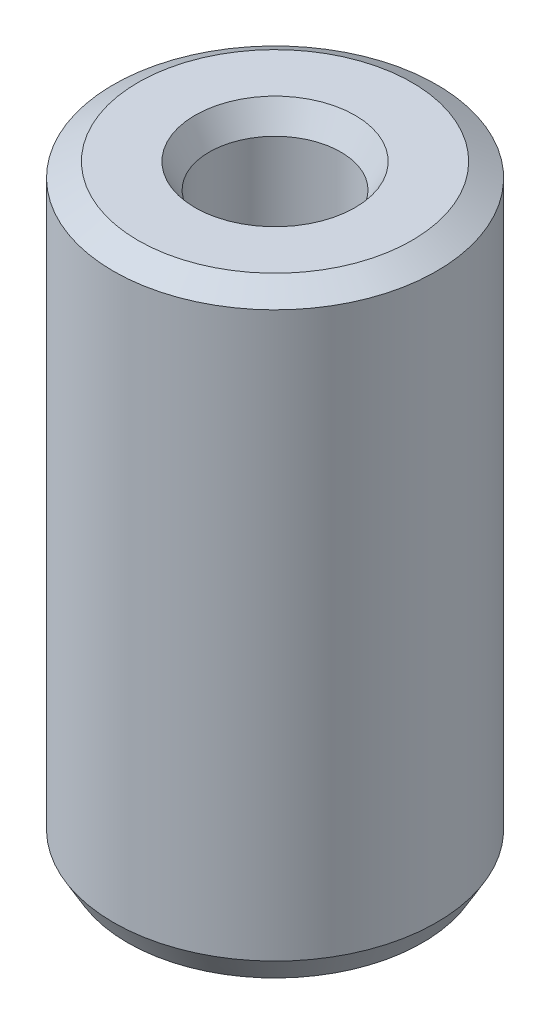
ISO-10303-21;
HEADER;
FILE_DESCRIPTION(('STEP AP214'),'2;1');
FILE_NAME('part.step','',(''),(''),'','','');
FILE_SCHEMA(('AUTOMOTIVE_DESIGN { 1 0 10303 214 1 1 1 1 }'));
ENDSEC;
DATA;
#1=APPLICATION_CONTEXT('core data for automotive mechanical design processes');
#2=APPLICATION_PROTOCOL_DEFINITION('international standard','automotive_design',2000,#1);
#3=PRODUCT_CONTEXT('',#1,'mechanical');
#4=PRODUCT('Part','Part','',(#3));
#5=PRODUCT_RELATED_PRODUCT_CATEGORY('part','',(#4));
#6=PRODUCT_DEFINITION_FORMATION('','',#4);
#7=PRODUCT_DEFINITION_CONTEXT('part definition',#1,'design');
#8=PRODUCT_DEFINITION('design','',#6,#7);
#9=PRODUCT_DEFINITION_SHAPE('','',#8);
#10=(LENGTH_UNIT() NAMED_UNIT(*) SI_UNIT(.MILLI.,.METRE.));
#11=(NAMED_UNIT(*) PLANE_ANGLE_UNIT() SI_UNIT($,.RADIAN.));
#12=(NAMED_UNIT(*) SI_UNIT($,.STERADIAN.) SOLID_ANGLE_UNIT());
#13=UNCERTAINTY_MEASURE_WITH_UNIT(LENGTH_MEASURE(1.E-05),#10,'distance_accuracy_value','');
#14=(GEOMETRIC_REPRESENTATION_CONTEXT(3) GLOBAL_UNCERTAINTY_ASSIGNED_CONTEXT((#13)) GLOBAL_UNIT_ASSIGNED_CONTEXT((#10,
#11,#12)) REPRESENTATION_CONTEXT('',''));
#15=CARTESIAN_POINT('',(0.,0.,0.));
#16=DIRECTION('',(0.,0.,1.));
#17=DIRECTION('',(1.,0.,0.));
#18=AXIS2_PLACEMENT_3D('',#15,#16,#17);
#19=CARTESIAN_POINT('',(0.,18.6532894214334,0.));
#20=DIRECTION('',(0.,-1.,0.));
#21=DIRECTION('',(0.,0.,-1.));
#22=AXIS2_PLACEMENT_3D('',#19,#20,#21);
#23=CYLINDRICAL_SURFACE('',#22,5.);
#24=CARTESIAN_POINT('',(0.,0.763976609178835,0.));
#25=DIRECTION('',(0.,1.,0.));
#26=DIRECTION('',(0.,0.,1.));
#27=AXIS2_PLACEMENT_3D('',#24,#25,#26);
#28=CIRCLE('',#27,5.);
#29=CARTESIAN_POINT('',(0.,0.763976609178835,5.));
#30=VERTEX_POINT('',#29);
#31=EDGE_CURVE('E10',#30,#30,#28,.T.);
#32=ORIENTED_EDGE('',*,*,#31,.T.);
#33=EDGE_LOOP('',(#32));
#34=FACE_BOUND('',#33,.T.);
#35=CARTESIAN_POINT('',(0.,18.2122073204694,0.));
#36=DIRECTION('',(0.,1.,0.));
#37=DIRECTION('',(0.,0.,1.));
#38=AXIS2_PLACEMENT_3D('',#35,#36,#37);
#39=CIRCLE('',#38,5.);
#40=CARTESIAN_POINT('',(0.,18.2122073204694,5.));
#41=VERTEX_POINT('',#40);
#42=EDGE_CURVE('E50',#41,#41,#39,.F.);
#43=ORIENTED_EDGE('',*,*,#42,.T.);
#44=EDGE_LOOP('',(#43));
#45=FACE_BOUND('',#44,.T.);
#46=ADVANCED_FACE('F39',(#34,#45),#23,.T.);
#47=CARTESIAN_POINT('',(0.,18.6532894214334,0.));
#48=DIRECTION('',(0.,1.,0.));
#49=DIRECTION('',(0.,0.,1.));
#50=AXIS2_PLACEMENT_3D('',#47,#48,#49);
#51=PLANE('',#50);
#52=CARTESIAN_POINT('',(0.,18.6532894214334,0.));
#53=DIRECTION('',(0.,1.,0.));
#54=DIRECTION('',(0.,0.,1.));
#55=AXIS2_PLACEMENT_3D('',#52,#53,#54);
#56=CIRCLE('',#55,2.47543016761892);
#57=CARTESIAN_POINT('',(0.,18.6532894214334,2.47543016761892));
#58=VERTEX_POINT('',#57);
#59=EDGE_CURVE('E58',#58,#58,#56,.F.);
#60=ORIENTED_EDGE('',*,*,#59,.T.);
#61=EDGE_LOOP('',(#60));
#62=FACE_BOUND('',#61,.T.);
#63=CARTESIAN_POINT('',(0.,18.6532894214334,0.));
#64=DIRECTION('',(0.,1.,0.));
#65=DIRECTION('',(0.,0.,1.));
#66=AXIS2_PLACEMENT_3D('',#63,#64,#65);
#67=CIRCLE('',#66,4.23602339082117);
#68=CARTESIAN_POINT('',(0.,18.6532894214334,4.23602339082117));
#69=VERTEX_POINT('',#68);
#70=EDGE_CURVE('E61',#69,#69,#67,.T.);
#71=ORIENTED_EDGE('',*,*,#70,.T.);
#72=EDGE_LOOP('',(#71));
#73=FACE_BOUND('',#72,.T.);
#74=ADVANCED_FACE('F88',(#62,#73),#51,.T.);
#75=CARTESIAN_POINT('',(0.,0.,0.));
#76=DIRECTION('',(0.,1.,0.));
#77=DIRECTION('',(0.,0.,1.));
#78=AXIS2_PLACEMENT_3D('',#75,#76,#77);
#79=PLANE('',#78);
#80=CARTESIAN_POINT('',(0.,0.,0.));
#81=DIRECTION('',(0.,1.,0.));
#82=DIRECTION('',(0.,0.,1.));
#83=AXIS2_PLACEMENT_3D('',#80,#81,#82);
#84=CIRCLE('',#83,2.79832467583377);
#85=CARTESIAN_POINT('',(0.,0.,2.79832467583377));
#86=VERTEX_POINT('',#85);
#87=EDGE_CURVE('E51',#86,#86,#84,.T.);
#88=ORIENTED_EDGE('',*,*,#87,.T.);
#89=EDGE_LOOP('',(#88));
#90=FACE_BOUND('',#89,.T.);
#91=CARTESIAN_POINT('',(0.,0.,0.));
#92=DIRECTION('',(0.,1.,0.));
#93=DIRECTION('',(0.,0.,1.));
#94=AXIS2_PLACEMENT_3D('',#91,#92,#93);
#95=CIRCLE('',#94,4.55891789903602);
#96=CARTESIAN_POINT('',(0.,0.,4.55891789903602));
#97=VERTEX_POINT('',#96);
#98=EDGE_CURVE('E54',#97,#97,#95,.F.);
#99=ORIENTED_EDGE('',*,*,#98,.T.);
#100=EDGE_LOOP('',(#99));
#101=FACE_BOUND('',#100,.T.);
#102=ADVANCED_FACE('F83',(#90,#101),#79,.F.);
#103=CARTESIAN_POINT('',(0.,18.6532894214334,0.));
#104=DIRECTION('',(0.,-1.,0.));
#105=DIRECTION('',(0.,0.,-1.));
#106=AXIS2_PLACEMENT_3D('',#103,#104,#105);
#107=CYLINDRICAL_SURFACE('',#106,2.03434806665494);
#108=CARTESIAN_POINT('',(0.,17.8893128122546,0.));
#109=DIRECTION('',(0.,1.,0.));
#110=DIRECTION('',(0.,0.,1.));
#111=AXIS2_PLACEMENT_3D('',#108,#109,#110);
#112=CIRCLE('',#111,2.03434806665494);
#113=CARTESIAN_POINT('',(0.,17.8893128122546,2.03434806665493));
#114=VERTEX_POINT('',#113);
#115=EDGE_CURVE('E67',#114,#114,#112,.T.);
#116=ORIENTED_EDGE('',*,*,#115,.T.);
#117=EDGE_LOOP('',(#116));
#118=FACE_BOUND('',#117,.T.);
#119=CARTESIAN_POINT('',(0.,0.441082100963979,0.));
#120=DIRECTION('',(0.,1.,0.));
#121=DIRECTION('',(0.,0.,1.));
#122=AXIS2_PLACEMENT_3D('',#119,#120,#121);
#123=CIRCLE('',#122,2.03434806665494);
#124=CARTESIAN_POINT('',(0.,0.441082100963979,2.03434806665494));
#125=VERTEX_POINT('',#124);
#126=EDGE_CURVE('E69',#125,#125,#123,.F.);
#127=ORIENTED_EDGE('',*,*,#126,.T.);
#128=EDGE_LOOP('',(#127));
#129=FACE_BOUND('',#128,.T.);
#130=ADVANCED_FACE('F71',(#118,#129),#107,.F.);
#131=CARTESIAN_POINT('',(0.,17.8893128122546,0.));
#132=DIRECTION('',(0.,1.,0.));
#133=DIRECTION('',(0.,0.,1.));
#134=AXIS2_PLACEMENT_3D('',#131,#132,#133);
#135=CONICAL_SURFACE('',#134,2.03434806665494,0.5235987755983);
#136=CARTESIAN_POINT('',(0.,18.6532894214334,2.47543016761892));
#137=CARTESIAN_POINT('',(0.,18.6453313317545,2.47083556240054));
#138=CARTESIAN_POINT('',(0.,18.6373732420755,2.46624095718217));
#139=CARTESIAN_POINT('',(0.,18.6214570627176,2.45705174674542));
#140=CARTESIAN_POINT('',(0.,18.6134989730387,2.45245714152704));
#141=CARTESIAN_POINT('',(0.,18.5975827936808,2.44326793109029));
#142=CARTESIAN_POINT('',(0.,18.5896247040018,2.43867332587192));
#143=CARTESIAN_POINT('',(0.,18.5737085246439,2.42948411543517));
#144=CARTESIAN_POINT('',(0.,18.565750434965,2.42488951021679));
#145=CARTESIAN_POINT('',(0.,18.5498342556071,2.41570029978004));
#146=CARTESIAN_POINT('',(0.,18.5418761659282,2.41110569456167));
#147=CARTESIAN_POINT('',(0.,18.5259599865703,2.40191648412492));
#148=CARTESIAN_POINT('',(0.,18.5180018968913,2.39732187890655));
#149=CARTESIAN_POINT('',(0.,18.5020857175334,2.3881326684698));
#150=CARTESIAN_POINT('',(0.,18.4941276278545,2.38353806325142));
#151=CARTESIAN_POINT('',(0.,18.4782114484966,2.37434885281467));
#152=CARTESIAN_POINT('',(0.,18.4702533588176,2.3697542475963));
#153=CARTESIAN_POINT('',(0.,18.4543371794597,2.36056503715955));
#154=CARTESIAN_POINT('',(0.,18.4463790897808,2.35597043194117));
#155=CARTESIAN_POINT('',(0.,18.4304629104229,2.34678122150442));
#156=CARTESIAN_POINT('',(0.,18.422504820744,2.34218661628605));
#157=CARTESIAN_POINT('',(0.,18.4065886413861,2.3329974058493));
#158=CARTESIAN_POINT('',(0.,18.3986305517071,2.32840280063092));
#159=CARTESIAN_POINT('',(0.,18.3827143723492,2.31921359019417));
#160=CARTESIAN_POINT('',(0.,18.3747562826703,2.3146189849758));
#161=CARTESIAN_POINT('',(0.,18.3588401033124,2.30542977453905));
#162=CARTESIAN_POINT('',(0.,18.3508820136334,2.30083516932067));
#163=CARTESIAN_POINT('',(0.,18.3349658342756,2.29164595888392));
#164=CARTESIAN_POINT('',(0.,18.3270077445966,2.28705135366555));
#165=CARTESIAN_POINT('',(0.,18.3110915652387,2.2778621432288));
#166=CARTESIAN_POINT('',(0.,18.3031334755598,2.27326753801042));
#167=CARTESIAN_POINT('',(0.,18.2872172962019,2.26407832757368));
#168=CARTESIAN_POINT('',(0.,18.2792592065229,2.2594837223553));
#169=CARTESIAN_POINT('',(0.,18.263343027165,2.25029451191855));
#170=CARTESIAN_POINT('',(0.,18.2553849374861,2.24569990670018));
#171=CARTESIAN_POINT('',(0.,18.2394687581282,2.23651069626343));
#172=CARTESIAN_POINT('',(0.,18.2315106684493,2.23191609104505));
#173=CARTESIAN_POINT('',(0.,18.2155944890914,2.2227268806083));
#174=CARTESIAN_POINT('',(0.,18.2076363994124,2.21813227538993));
#175=CARTESIAN_POINT('',(0.,18.1917202200545,2.20894306495318));
#176=CARTESIAN_POINT('',(0.,18.1837621303756,2.2043484597348));
#177=CARTESIAN_POINT('',(0.,18.1678459510177,2.19515924929805));
#178=CARTESIAN_POINT('',(0.,18.1598878613387,2.19056464407968));
#179=CARTESIAN_POINT('',(0.,18.1439716819808,2.18137543364293));
#180=CARTESIAN_POINT('',(0.,18.1360135923019,2.17678082842455));
#181=CARTESIAN_POINT('',(0.,18.120097412944,2.1675916179878));
#182=CARTESIAN_POINT('',(0.,18.1121393232651,2.16299701276943));
#183=CARTESIAN_POINT('',(0.,18.0962231439072,2.15380780233268));
#184=CARTESIAN_POINT('',(0.,18.0882650542282,2.1492131971143));
#185=CARTESIAN_POINT('',(0.,18.0723488748703,2.14002398667756));
#186=CARTESIAN_POINT('',(0.,18.0643907851914,2.13542938145918));
#187=CARTESIAN_POINT('',(0.,18.0484746058335,2.12624017102243));
#188=CARTESIAN_POINT('',(0.,18.0405165161545,2.12164556580406));
#189=CARTESIAN_POINT('',(0.,18.0246003367967,2.11245635536731));
#190=CARTESIAN_POINT('',(0.,18.0166422471177,2.10786175014893));
#191=CARTESIAN_POINT('',(0.,18.0007260677598,2.09867253971218));
#192=CARTESIAN_POINT('',(0.,17.9927679780809,2.09407793449381));
#193=CARTESIAN_POINT('',(0.,17.976851798723,2.08488872405706));
#194=CARTESIAN_POINT('',(0.,17.968893709044,2.08029411883868));
#195=CARTESIAN_POINT('',(0.,17.9529775296861,2.07110490840193));
#196=CARTESIAN_POINT('',(0.,17.9450194400072,2.06651030318356));
#197=CARTESIAN_POINT('',(0.,17.9291032606493,2.05732109274681));
#198=CARTESIAN_POINT('',(0.,17.9211451709704,2.05272648752843));
#199=CARTESIAN_POINT('',(0.,17.9052289916125,2.04353727709168));
#200=CARTESIAN_POINT('',(0.,17.8972709019335,2.03894267187331));
#201=CARTESIAN_POINT('',(0.,17.8893128122546,2.03434806665493));
#202=B_SPLINE_CURVE_WITH_KNOTS('',3,(#136,#137,#138,#139,#140,#141,#142,#143,#144,#145,#146,
#147,#148,#149,#150,#151,#152,#153,#154,#155,#156,#157,#158,#159,#160,#161,#162,#163,#164,#165,
#166,#167,#168,#169,#170,#171,#172,#173,#174,#175,#176,#177,#178,#179,#180,#181,#182,#183,#184,
#185,#186,#187,#188,#189,#190,#191,#192,#193,#194,#195,#196,#197,#198,#199,#200,#201),
.UNSPECIFIED.,.F.,.F.,(4,2,2,2,2,2,2,2,2,2,2,2,2,2,2,2,2,2,2,2,2,2,2,2,2,2,2,2,2,2,2,2,4),(0.,
0.0275676313102482,0.0551352626204965,0.0827028939307447,0.110270525240993,0.137838156551241,
0.165405787861492,0.192973419171741,0.220541050481989,0.248108681792237,0.275676313102485,
0.303243944412737,0.330811575722985,0.358379207033233,0.385946838343481,0.413514469653729,
0.441082100963981,0.468649732274229,0.496217363584477,0.523784994894725,0.551352626204974,
0.578920257515222,0.606487888825473,0.634055520135721,0.66162315144597,0.689190782756218,
0.716758414066466,0.744326045376717,0.771893676686966,0.799461307997214,0.827028939307462,
0.85459657061771,0.882164201927958),.UNSPECIFIED.);
#203=EDGE_CURVE('BSEAM77',#58,#114,#202,.T.);
#204=ORIENTED_EDGE('',*,*,#59,.F.);
#205=ORIENTED_EDGE('',*,*,#115,.F.);
#206=ORIENTED_EDGE('',*,*,#203,.T.);
#207=ORIENTED_EDGE('',*,*,#203,.F.);
#208=EDGE_LOOP('',(#204,#206,#205,#207));
#209=FACE_BOUND('',#208,.T.);
#210=ADVANCED_FACE('F77',(#209),#135,.F.);
#211=CARTESIAN_POINT('',(0.,0.,0.));
#212=DIRECTION('',(0.,-1.,0.));
#213=DIRECTION('',(0.,0.,-1.));
#214=AXIS2_PLACEMENT_3D('',#211,#212,#213);
#215=CONICAL_SURFACE('',#214,2.79832467583377,1.04719755119659);
#216=ORIENTED_EDGE('',*,*,#126,.F.);
#217=EDGE_LOOP('',(#216));
#218=FACE_BOUND('',#217,.T.);
#219=ORIENTED_EDGE('',*,*,#87,.F.);
#220=EDGE_LOOP('',(#219));
#221=FACE_BOUND('',#220,.T.);
#222=ADVANCED_FACE('F73',(#218,#221),#215,.F.);
#223=CARTESIAN_POINT('',(0.,0.763976609178835,0.));
#224=DIRECTION('',(0.,1.,0.));
#225=DIRECTION('',(0.,0.,1.));
#226=AXIS2_PLACEMENT_3D('',#223,#224,#225);
#227=CONICAL_SURFACE('',#226,5.,0.523598775598303);
#228=ORIENTED_EDGE('',*,*,#98,.F.);
#229=EDGE_LOOP('',(#228));
#230=FACE_BOUND('',#229,.T.);
#231=ORIENTED_EDGE('',*,*,#31,.F.);
#232=EDGE_LOOP('',(#231));
#233=FACE_BOUND('',#232,.T.);
#234=ADVANCED_FACE('F76',(#230,#233),#227,.T.);
#235=CARTESIAN_POINT('',(0.,18.6532894214334,0.));
#236=DIRECTION('',(0.,-1.,0.));
#237=DIRECTION('',(0.,0.,-1.));
#238=AXIS2_PLACEMENT_3D('',#235,#236,#237);
#239=CONICAL_SURFACE('',#238,4.23602339082117,1.0471975511966);
#240=ORIENTED_EDGE('',*,*,#42,.F.);
#241=EDGE_LOOP('',(#240));
#242=FACE_BOUND('',#241,.T.);
#243=ORIENTED_EDGE('',*,*,#70,.F.);
#244=EDGE_LOOP('',(#243));
#245=FACE_BOUND('',#244,.T.);
#246=ADVANCED_FACE('F45',(#242,#245),#239,.T.);
#247=CLOSED_SHELL('',(#46,#74,#102,#130,#210,#222,#234,#246));
#248=MANIFOLD_SOLID_BREP('B2',#247);
#249=ADVANCED_BREP_SHAPE_REPRESENTATION('',(#18,#248),#14);
#250=SHAPE_DEFINITION_REPRESENTATION(#9,#249);
ENDSEC;
END-ISO-10303-21;
